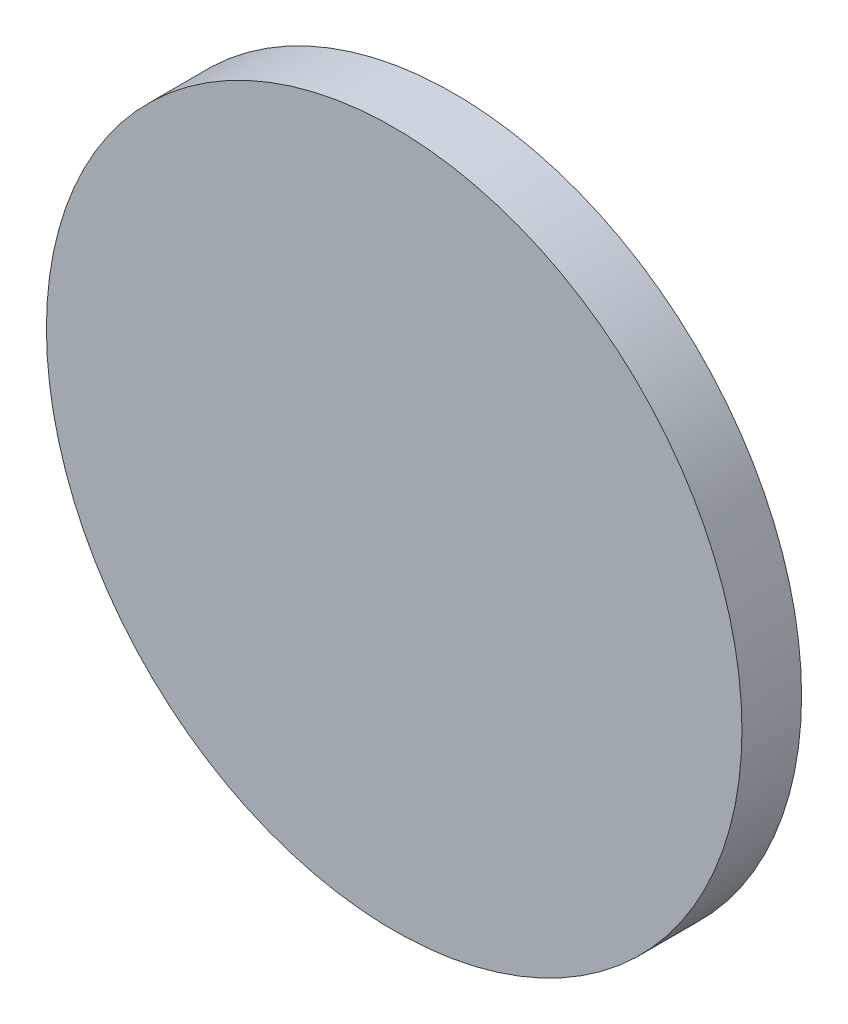
ISO-10303-21;
HEADER;
FILE_DESCRIPTION(('STEP AP214'),'2;1');
FILE_NAME('part.step','',(''),(''),'','','');
FILE_SCHEMA(('AUTOMOTIVE_DESIGN { 1 0 10303 214 1 1 1 1 }'));
ENDSEC;
DATA;
#1=APPLICATION_CONTEXT('core data for automotive mechanical design processes');
#2=APPLICATION_PROTOCOL_DEFINITION('international standard','automotive_design',2000,#1);
#3=PRODUCT_CONTEXT('',#1,'mechanical');
#4=PRODUCT('Part','Part','',(#3));
#5=PRODUCT_RELATED_PRODUCT_CATEGORY('part','',(#4));
#6=PRODUCT_DEFINITION_FORMATION('','',#4);
#7=PRODUCT_DEFINITION_CONTEXT('part definition',#1,'design');
#8=PRODUCT_DEFINITION('design','',#6,#7);
#9=PRODUCT_DEFINITION_SHAPE('','',#8);
#10=(LENGTH_UNIT() NAMED_UNIT(*) SI_UNIT(.MILLI.,.METRE.));
#11=(NAMED_UNIT(*) PLANE_ANGLE_UNIT() SI_UNIT($,.RADIAN.));
#12=(NAMED_UNIT(*) SI_UNIT($,.STERADIAN.) SOLID_ANGLE_UNIT());
#13=UNCERTAINTY_MEASURE_WITH_UNIT(LENGTH_MEASURE(1.E-05),#10,'distance_accuracy_value','');
#14=(GEOMETRIC_REPRESENTATION_CONTEXT(3) GLOBAL_UNCERTAINTY_ASSIGNED_CONTEXT((#13)) GLOBAL_UNIT_ASSIGNED_CONTEXT((#10,
#11,#12)) REPRESENTATION_CONTEXT('',''));
#15=CARTESIAN_POINT('',(0.,0.,0.));
#16=DIRECTION('',(0.,0.,1.));
#17=DIRECTION('',(1.,0.,0.));
#18=AXIS2_PLACEMENT_3D('',#15,#16,#17);
#19=CARTESIAN_POINT('',(10.9013,5.849620014875,0.76487));
#20=DIRECTION('',(0.,0.,-1.));
#21=DIRECTION('',(-1.,0.,0.));
#22=AXIS2_PLACEMENT_3D('',#19,#20,#21);
#23=PLANE('',#22);
#24=CARTESIAN_POINT('',(10.9013,5.849620014875,0.76487));
#25=DIRECTION('',(0.,0.,1.));
#26=DIRECTION('',(1.,0.,0.));
#27=AXIS2_PLACEMENT_3D('',#24,#25,#26);
#28=CIRCLE('',#27,0.200024667);
#29=CARTESIAN_POINT('',(11.101324667,5.849620014875,0.76487));
#30=VERTEX_POINT('',#29);
#31=EDGE_CURVE('E18',#30,#30,#28,.T.);
#32=ORIENTED_EDGE('',*,*,#31,.F.);
#33=EDGE_LOOP('',(#32));
#34=FACE_BOUND('',#33,.T.);
#35=ADVANCED_FACE('F15',(#34),#23,.T.);
#36=CARTESIAN_POINT('',(10.9013,5.849620014875,0.76487));
#37=DIRECTION('',(0.,0.,1.));
#38=DIRECTION('',(1.,0.,0.));
#39=AXIS2_PLACEMENT_3D('',#36,#37,#38);
#40=CYLINDRICAL_SURFACE('',#39,0.200024667);
#41=CARTESIAN_POINT('',(10.9013,5.849620014875,0.79916));
#42=DIRECTION('',(0.,0.,1.));
#43=DIRECTION('',(1.,0.,0.));
#44=AXIS2_PLACEMENT_3D('',#41,#42,#43);
#45=CIRCLE('',#44,0.200024667);
#46=CARTESIAN_POINT('',(11.101324667,5.849620014875,0.79916));
#47=VERTEX_POINT('',#46);
#48=EDGE_CURVE('E10',#47,#47,#45,.T.);
#49=ORIENTED_EDGE('',*,*,#48,.F.);
#50=EDGE_LOOP('',(#49));
#51=FACE_BOUND('',#50,.T.);
#52=ORIENTED_EDGE('',*,*,#31,.T.);
#53=EDGE_LOOP('',(#52));
#54=FACE_BOUND('',#53,.T.);
#55=ADVANCED_FACE('F27',(#51,#54),#40,.T.);
#56=CARTESIAN_POINT('',(10.9013,5.849620014875,0.79916));
#57=DIRECTION('',(0.,0.,1.));
#58=DIRECTION('',(1.,0.,0.));
#59=AXIS2_PLACEMENT_3D('',#56,#57,#58);
#60=PLANE('',#59);
#61=ORIENTED_EDGE('',*,*,#48,.T.);
#62=EDGE_LOOP('',(#61));
#63=FACE_BOUND('',#62,.T.);
#64=ADVANCED_FACE('F34',(#63),#60,.T.);
#65=CLOSED_SHELL('',(#35,#55,#64));
#66=MANIFOLD_SOLID_BREP('B1',#65);
#67=ADVANCED_BREP_SHAPE_REPRESENTATION('',(#18,#66),#14);
#68=SHAPE_DEFINITION_REPRESENTATION(#9,#67);
ENDSEC;
END-ISO-10303-21;
